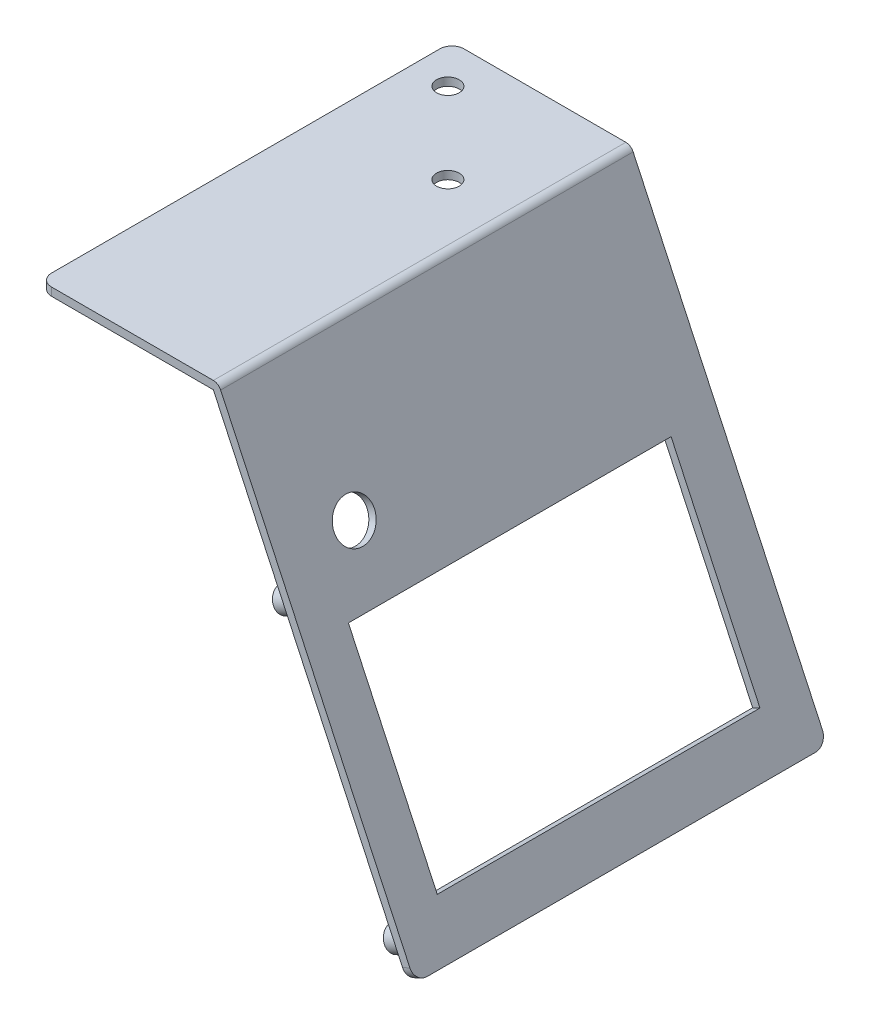
ISO-10303-21;
HEADER;
FILE_DESCRIPTION(('STEP AP214'),'2;1');
FILE_NAME('part.step','',(''),(''),'','','');
FILE_SCHEMA(('AUTOMOTIVE_DESIGN { 1 0 10303 214 1 1 1 1 }'));
ENDSEC;
DATA;
#1=APPLICATION_CONTEXT('core data for automotive mechanical design processes');
#2=APPLICATION_PROTOCOL_DEFINITION('international standard','automotive_design',2000,#1);
#3=PRODUCT_CONTEXT('',#1,'mechanical');
#4=PRODUCT('Part','Part','',(#3));
#5=PRODUCT_RELATED_PRODUCT_CATEGORY('part','',(#4));
#6=PRODUCT_DEFINITION_FORMATION('','',#4);
#7=PRODUCT_DEFINITION_CONTEXT('part definition',#1,'design');
#8=PRODUCT_DEFINITION('design','',#6,#7);
#9=PRODUCT_DEFINITION_SHAPE('','',#8);
#10=(LENGTH_UNIT() NAMED_UNIT(*) SI_UNIT(.MILLI.,.METRE.));
#11=(NAMED_UNIT(*) PLANE_ANGLE_UNIT() SI_UNIT($,.RADIAN.));
#12=(NAMED_UNIT(*) SI_UNIT($,.STERADIAN.) SOLID_ANGLE_UNIT());
#13=UNCERTAINTY_MEASURE_WITH_UNIT(LENGTH_MEASURE(1.E-05),#10,'distance_accuracy_value','');
#14=(GEOMETRIC_REPRESENTATION_CONTEXT(3) GLOBAL_UNCERTAINTY_ASSIGNED_CONTEXT((#13)) GLOBAL_UNIT_ASSIGNED_CONTEXT((#10,
#11,#12)) REPRESENTATION_CONTEXT('',''));
#15=CARTESIAN_POINT('',(0.,0.,0.));
#16=DIRECTION('',(0.,0.,1.));
#17=DIRECTION('',(1.,0.,0.));
#18=AXIS2_PLACEMENT_3D('',#15,#16,#17);
#19=CARTESIAN_POINT('',(34.5538891651414,16.1127431367447,0.));
#20=DIRECTION('',(0.906307787036648,0.422618261740704,0.));
#21=DIRECTION('',(-0.422618261740704,0.906307787036648,0.));
#22=AXIS2_PLACEMENT_3D('',#19,#20,#21);
#23=PLANE('',#22);
#24=CARTESIAN_POINT('',(61.1600718501967,-40.9443997596972,8.04999999999999));
#25=DIRECTION('',(0.906307787036648,0.422618261740704,0.));
#26=DIRECTION('',(-0.422618261740704,0.906307787036648,0.));
#27=AXIS2_PLACEMENT_3D('',#24,#25,#26);
#28=CIRCLE('',#27,1.35);
#29=CARTESIAN_POINT('',(60.5895371968468,-39.7208842471977,8.04999999999999));
#30=VERTEX_POINT('',#29);
#31=EDGE_CURVE('E22',#30,#30,#28,.F.);
#32=ORIENTED_EDGE('',*,*,#31,.T.);
#33=EDGE_LOOP('',(#32));
#34=FACE_BOUND('',#33,.T.);
#35=ADVANCED_FACE('F19',(#34),#23,.F.);
#36=CARTESIAN_POINT('',(34.5538891651414,16.1127431367447,0.));
#37=DIRECTION('',(0.906307787036648,0.422618261740704,0.));
#38=DIRECTION('',(-0.422618261740704,0.906307787036648,0.));
#39=AXIS2_PLACEMENT_3D('',#36,#37,#38);
#40=PLANE('',#39);
#41=CARTESIAN_POINT('',(88.5879970371684,-99.7637751383756,8.04999999999999));
#42=DIRECTION('',(0.906307787036648,0.422618261740704,0.));
#43=DIRECTION('',(-0.422618261740704,0.906307787036648,0.));
#44=AXIS2_PLACEMENT_3D('',#41,#42,#43);
#45=CIRCLE('',#44,1.34999999999999);
#46=CARTESIAN_POINT('',(88.0174623838184,-98.5402596258762,8.04999999999999));
#47=VERTEX_POINT('',#46);
#48=EDGE_CURVE('E235',#47,#47,#45,.F.);
#49=ORIENTED_EDGE('',*,*,#48,.T.);
#50=EDGE_LOOP('',(#49));
#51=FACE_BOUND('',#50,.T.);
#52=ADVANCED_FACE('F386',(#51),#40,.F.);
#53=CARTESIAN_POINT('',(34.5538891651414,16.1127431367447,0.));
#54=DIRECTION('',(0.906307787036648,0.422618261740704,0.));
#55=DIRECTION('',(-0.422618261740704,0.906307787036648,0.));
#56=AXIS2_PLACEMENT_3D('',#53,#54,#55);
#57=PLANE('',#56);
#58=CARTESIAN_POINT('',(88.5879970371684,-99.7637751383756,95.95));
#59=DIRECTION('',(0.906307787036648,0.422618261740704,0.));
#60=DIRECTION('',(-0.422618261740704,0.906307787036648,0.));
#61=AXIS2_PLACEMENT_3D('',#58,#59,#60);
#62=CIRCLE('',#61,1.35000000000001);
#63=CARTESIAN_POINT('',(88.0174623838184,-98.5402596258762,95.95));
#64=VERTEX_POINT('',#63);
#65=EDGE_CURVE('E233',#64,#64,#62,.F.);
#66=ORIENTED_EDGE('',*,*,#65,.T.);
#67=EDGE_LOOP('',(#66));
#68=FACE_BOUND('',#67,.T.);
#69=ADVANCED_FACE('F257',(#68),#57,.F.);
#70=CARTESIAN_POINT('',(34.5538891651414,16.1127431367447,0.));
#71=DIRECTION('',(0.906307787036648,0.422618261740704,0.));
#72=DIRECTION('',(-0.422618261740704,0.906307787036648,0.));
#73=AXIS2_PLACEMENT_3D('',#70,#71,#72);
#74=PLANE('',#73);
#75=CARTESIAN_POINT('',(61.1600718501967,-40.9443997596972,95.95));
#76=DIRECTION('',(0.906307787036648,0.422618261740704,0.));
#77=DIRECTION('',(-0.422618261740704,0.906307787036648,0.));
#78=AXIS2_PLACEMENT_3D('',#75,#76,#77);
#79=CIRCLE('',#78,1.35000000000001);
#80=CARTESIAN_POINT('',(60.5895371968467,-39.7208842471977,95.95));
#81=VERTEX_POINT('',#80);
#82=EDGE_CURVE('E230',#81,#81,#79,.F.);
#83=ORIENTED_EDGE('',*,*,#82,.T.);
#84=EDGE_LOOP('',(#83));
#85=FACE_BOUND('',#84,.T.);
#86=ADVANCED_FACE('F246',(#85),#74,.F.);
#87=CARTESIAN_POINT('',(54.8159173409402,-43.9027275918821,8.04999999999999));
#88=DIRECTION('',(0.906307787036648,0.422618261740704,0.));
#89=DIRECTION('',(-0.422618261740704,0.906307787036648,0.));
#90=AXIS2_PLACEMENT_3D('',#87,#88,#89);
#91=CYLINDRICAL_SURFACE('',#90,1.35);
#92=CARTESIAN_POINT('',(54.8159173409402,-43.9027275918821,8.04999999999999));
#93=DIRECTION('',(0.906307787036648,0.422618261740704,0.));
#94=DIRECTION('',(-0.422618261740704,0.906307787036648,0.));
#95=AXIS2_PLACEMENT_3D('',#92,#93,#94);
#96=CIRCLE('',#95,1.35);
#97=CARTESIAN_POINT('',(54.2453826875902,-42.6792120793826,8.04999999999999));
#98=VERTEX_POINT('',#97);
#99=EDGE_CURVE('E227',#98,#98,#96,.F.);
#100=ORIENTED_EDGE('',*,*,#99,.T.);
#101=EDGE_LOOP('',(#100));
#102=FACE_BOUND('',#101,.T.);
#103=ORIENTED_EDGE('',*,*,#31,.F.);
#104=EDGE_LOOP('',(#103));
#105=FACE_BOUND('',#104,.T.);
#106=ADVANCED_FACE('F243',(#102,#105),#91,.F.);
#107=CARTESIAN_POINT('',(82.2438425279118,-102.722102970561,8.04999999999999));
#108=DIRECTION('',(0.906307787036648,0.422618261740704,0.));
#109=DIRECTION('',(-0.422618261740704,0.906307787036648,0.));
#110=AXIS2_PLACEMENT_3D('',#107,#108,#109);
#111=CYLINDRICAL_SURFACE('',#110,1.34999999999999);
#112=CARTESIAN_POINT('',(82.2438425279118,-102.722102970561,8.04999999999999));
#113=DIRECTION('',(0.906307787036648,0.422618261740704,0.));
#114=DIRECTION('',(-0.422618261740704,0.906307787036648,0.));
#115=AXIS2_PLACEMENT_3D('',#112,#113,#114);
#116=CIRCLE('',#115,1.34999999999999);
#117=CARTESIAN_POINT('',(81.6733078745619,-101.498587458061,8.04999999999999));
#118=VERTEX_POINT('',#117);
#119=EDGE_CURVE('E224',#118,#118,#116,.F.);
#120=ORIENTED_EDGE('',*,*,#119,.T.);
#121=EDGE_LOOP('',(#120));
#122=FACE_BOUND('',#121,.T.);
#123=ORIENTED_EDGE('',*,*,#48,.F.);
#124=EDGE_LOOP('',(#123));
#125=FACE_BOUND('',#124,.T.);
#126=ADVANCED_FACE('F245',(#122,#125),#111,.F.);
#127=CARTESIAN_POINT('',(82.2438425279118,-102.722102970561,95.95));
#128=DIRECTION('',(0.906307787036648,0.422618261740704,0.));
#129=DIRECTION('',(-0.422618261740704,0.906307787036648,0.));
#130=AXIS2_PLACEMENT_3D('',#127,#128,#129);
#131=CYLINDRICAL_SURFACE('',#130,1.35000000000001);
#132=CARTESIAN_POINT('',(82.2438425279118,-102.722102970561,95.95));
#133=DIRECTION('',(0.906307787036648,0.422618261740704,0.));
#134=DIRECTION('',(-0.422618261740704,0.906307787036648,0.));
#135=AXIS2_PLACEMENT_3D('',#132,#133,#134);
#136=CIRCLE('',#135,1.35000000000001);
#137=CARTESIAN_POINT('',(81.6733078745619,-101.498587458061,95.95));
#138=VERTEX_POINT('',#137);
#139=EDGE_CURVE('E221',#138,#138,#136,.F.);
#140=ORIENTED_EDGE('',*,*,#139,.T.);
#141=EDGE_LOOP('',(#140));
#142=FACE_BOUND('',#141,.T.);
#143=ORIENTED_EDGE('',*,*,#65,.F.);
#144=EDGE_LOOP('',(#143));
#145=FACE_BOUND('',#144,.T.);
#146=ADVANCED_FACE('F254',(#142,#145),#131,.F.);
#147=CARTESIAN_POINT('',(54.8159173409402,-43.9027275918821,95.95));
#148=DIRECTION('',(0.906307787036648,0.422618261740704,0.));
#149=DIRECTION('',(-0.422618261740704,0.906307787036648,0.));
#150=AXIS2_PLACEMENT_3D('',#147,#148,#149);
#151=CYLINDRICAL_SURFACE('',#150,1.35000000000001);
#152=CARTESIAN_POINT('',(54.8159173409402,-43.9027275918821,95.95));
#153=DIRECTION('',(0.906307787036648,0.422618261740704,0.));
#154=DIRECTION('',(-0.422618261740704,0.906307787036648,0.));
#155=AXIS2_PLACEMENT_3D('',#152,#153,#154);
#156=CIRCLE('',#155,1.35000000000001);
#157=CARTESIAN_POINT('',(54.2453826875902,-42.6792120793826,95.95));
#158=VERTEX_POINT('',#157);
#159=EDGE_CURVE('E145',#158,#158,#156,.F.);
#160=ORIENTED_EDGE('',*,*,#159,.T.);
#161=EDGE_LOOP('',(#160));
#162=FACE_BOUND('',#161,.T.);
#163=ORIENTED_EDGE('',*,*,#82,.F.);
#164=EDGE_LOOP('',(#163));
#165=FACE_BOUND('',#164,.T.);
#166=ADVANCED_FACE('F372',(#162,#165),#151,.F.);
#167=CARTESIAN_POINT('',(54.8159173409402,-43.9027275918821,8.04999999999999));
#168=DIRECTION('',(0.906307787036648,0.422618261740704,0.));
#169=DIRECTION('',(-0.422618261740704,0.906307787036648,0.));
#170=AXIS2_PLACEMENT_3D('',#167,#168,#169);
#171=PLANE('',#170);
#172=CARTESIAN_POINT('',(54.8159173409402,-43.9027275918821,8.04999999999999));
#173=DIRECTION('',(0.906307787036648,0.422618261740704,0.));
#174=DIRECTION('',(-0.422618261740704,0.906307787036648,0.));
#175=AXIS2_PLACEMENT_3D('',#172,#173,#174);
#176=CIRCLE('',#175,3.);
#177=CARTESIAN_POINT('',(53.5480625557181,-41.1838042307722,8.04999999999999));
#178=VERTEX_POINT('',#177);
#179=EDGE_CURVE('E121',#178,#178,#176,.T.);
#180=ORIENTED_EDGE('',*,*,#179,.F.);
#181=EDGE_LOOP('',(#180));
#182=FACE_BOUND('',#181,.T.);
#183=ORIENTED_EDGE('',*,*,#99,.F.);
#184=EDGE_LOOP('',(#183));
#185=FACE_BOUND('',#184,.T.);
#186=ADVANCED_FACE('F368',(#182,#185),#171,.F.);
#187=CARTESIAN_POINT('',(82.2438425279118,-102.722102970561,8.04999999999999));
#188=DIRECTION('',(0.906307787036648,0.422618261740704,0.));
#189=DIRECTION('',(-0.422618261740704,0.906307787036648,0.));
#190=AXIS2_PLACEMENT_3D('',#187,#188,#189);
#191=PLANE('',#190);
#192=CARTESIAN_POINT('',(82.2438425279118,-102.722102970561,8.04999999999999));
#193=DIRECTION('',(0.906307787036648,0.422618261740704,0.));
#194=DIRECTION('',(-0.422618261740704,0.906307787036648,0.));
#195=AXIS2_PLACEMENT_3D('',#192,#193,#194);
#196=CIRCLE('',#195,3.);
#197=CARTESIAN_POINT('',(80.9759877426897,-100.003179609451,8.04999999999999));
#198=VERTEX_POINT('',#197);
#199=EDGE_CURVE('E214',#198,#198,#196,.T.);
#200=ORIENTED_EDGE('',*,*,#199,.F.);
#201=EDGE_LOOP('',(#200));
#202=FACE_BOUND('',#201,.T.);
#203=ORIENTED_EDGE('',*,*,#119,.F.);
#204=EDGE_LOOP('',(#203));
#205=FACE_BOUND('',#204,.T.);
#206=ADVANCED_FACE('F364',(#202,#205),#191,.F.);
#207=CARTESIAN_POINT('',(82.2438425279118,-102.722102970561,95.95));
#208=DIRECTION('',(0.906307787036648,0.422618261740704,0.));
#209=DIRECTION('',(-0.422618261740704,0.906307787036648,0.));
#210=AXIS2_PLACEMENT_3D('',#207,#208,#209);
#211=PLANE('',#210);
#212=CARTESIAN_POINT('',(82.2438425279118,-102.722102970561,95.95));
#213=DIRECTION('',(0.906307787036648,0.422618261740704,0.));
#214=DIRECTION('',(-0.422618261740704,0.906307787036648,0.));
#215=AXIS2_PLACEMENT_3D('',#212,#213,#214);
#216=CIRCLE('',#215,3.);
#217=CARTESIAN_POINT('',(80.9759877426897,-100.003179609451,95.95));
#218=VERTEX_POINT('',#217);
#219=EDGE_CURVE('E211',#218,#218,#216,.T.);
#220=ORIENTED_EDGE('',*,*,#219,.F.);
#221=EDGE_LOOP('',(#220));
#222=FACE_BOUND('',#221,.T.);
#223=ORIENTED_EDGE('',*,*,#139,.F.);
#224=EDGE_LOOP('',(#223));
#225=FACE_BOUND('',#224,.T.);
#226=ADVANCED_FACE('F360',(#222,#225),#211,.F.);
#227=CARTESIAN_POINT('',(54.8159173409402,-43.9027275918821,95.95));
#228=DIRECTION('',(0.906307787036648,0.422618261740704,0.));
#229=DIRECTION('',(-0.422618261740704,0.906307787036648,0.));
#230=AXIS2_PLACEMENT_3D('',#227,#228,#229);
#231=PLANE('',#230);
#232=CARTESIAN_POINT('',(54.8159173409402,-43.9027275918821,95.95));
#233=DIRECTION('',(0.906307787036648,0.422618261740704,0.));
#234=DIRECTION('',(-0.422618261740704,0.906307787036648,0.));
#235=AXIS2_PLACEMENT_3D('',#232,#233,#234);
#236=CIRCLE('',#235,3.00000000000001);
#237=CARTESIAN_POINT('',(53.5480625557181,-41.1838042307722,95.95));
#238=VERTEX_POINT('',#237);
#239=EDGE_CURVE('E208',#238,#238,#236,.T.);
#240=ORIENTED_EDGE('',*,*,#239,.F.);
#241=EDGE_LOOP('',(#240));
#242=FACE_BOUND('',#241,.T.);
#243=ORIENTED_EDGE('',*,*,#159,.F.);
#244=EDGE_LOOP('',(#243));
#245=FACE_BOUND('',#244,.T.);
#246=ADVANCED_FACE('F356',(#242,#245),#231,.F.);
#247=CARTESIAN_POINT('',(28.9999999999989,-8.5,29.9999999999999));
#248=DIRECTION('',(0.,1.,0.));
#249=DIRECTION('',(0.,0.,1.));
#250=AXIS2_PLACEMENT_3D('',#247,#248,#249);
#251=CYLINDRICAL_SURFACE('',#250,2.80000000000107);
#252=CARTESIAN_POINT('',(28.9999999999989,0.,29.9999999999999));
#253=DIRECTION('',(0.,1.,0.));
#254=DIRECTION('',(0.,0.,1.));
#255=AXIS2_PLACEMENT_3D('',#252,#253,#254);
#256=CIRCLE('',#255,2.80000000000107);
#257=CARTESIAN_POINT('',(28.9999999999989,0.,32.800000000001));
#258=VERTEX_POINT('',#257);
#259=EDGE_CURVE('E198',#258,#258,#256,.F.);
#260=ORIENTED_EDGE('',*,*,#259,.F.);
#261=EDGE_LOOP('',(#260));
#262=FACE_BOUND('',#261,.T.);
#263=CARTESIAN_POINT('',(28.9999999999989,-2.,29.9999999999999));
#264=DIRECTION('',(0.,1.,0.));
#265=DIRECTION('',(0.,0.,1.));
#266=AXIS2_PLACEMENT_3D('',#263,#264,#265);
#267=CIRCLE('',#266,2.80000000000107);
#268=CARTESIAN_POINT('',(28.9999999999989,-2.,32.800000000001));
#269=VERTEX_POINT('',#268);
#270=EDGE_CURVE('E205',#269,#269,#267,.F.);
#271=ORIENTED_EDGE('',*,*,#270,.T.);
#272=EDGE_LOOP('',(#271));
#273=FACE_BOUND('',#272,.T.);
#274=ADVANCED_FACE('F352',(#262,#273),#251,.F.);
#275=CARTESIAN_POINT('',(8.99999999999888,-8.5,9.99999999999991));
#276=DIRECTION('',(0.,1.,0.));
#277=DIRECTION('',(0.,0.,1.));
#278=AXIS2_PLACEMENT_3D('',#275,#276,#277);
#279=CYLINDRICAL_SURFACE('',#278,2.80000000000107);
#280=CARTESIAN_POINT('',(8.99999999999888,0.,9.99999999999991));
#281=DIRECTION('',(0.,1.,0.));
#282=DIRECTION('',(0.,0.,1.));
#283=AXIS2_PLACEMENT_3D('',#280,#281,#282);
#284=CIRCLE('',#283,2.80000000000107);
#285=CARTESIAN_POINT('',(8.99999999999888,0.,12.800000000001));
#286=VERTEX_POINT('',#285);
#287=EDGE_CURVE('E195',#286,#286,#284,.F.);
#288=ORIENTED_EDGE('',*,*,#287,.F.);
#289=EDGE_LOOP('',(#288));
#290=FACE_BOUND('',#289,.T.);
#291=CARTESIAN_POINT('',(8.99999999999888,-2.,9.99999999999991));
#292=DIRECTION('',(0.,1.,0.));
#293=DIRECTION('',(0.,0.,1.));
#294=AXIS2_PLACEMENT_3D('',#291,#292,#293);
#295=CIRCLE('',#294,2.80000000000107);
#296=CARTESIAN_POINT('',(8.99999999999888,-2.,12.800000000001));
#297=VERTEX_POINT('',#296);
#298=EDGE_CURVE('E113',#297,#297,#295,.F.);
#299=ORIENTED_EDGE('',*,*,#298,.T.);
#300=EDGE_LOOP('',(#299));
#301=FACE_BOUND('',#300,.T.);
#302=ADVANCED_FACE('F348',(#290,#301),#279,.F.);
#303=CARTESIAN_POINT('',(3.,0.,3.));
#304=DIRECTION('',(0.,1.,0.));
#305=DIRECTION('',(0.,0.,1.));
#306=AXIS2_PLACEMENT_3D('',#303,#304,#305);
#307=CYLINDRICAL_SURFACE('',#306,3.);
#308=CARTESIAN_POINT('',(3.,0.,3.));
#309=DIRECTION('',(0.,1.,0.));
#310=DIRECTION('',(0.,0.,1.));
#311=AXIS2_PLACEMENT_3D('',#308,#309,#310);
#312=CIRCLE('',#311,3.);
#313=CARTESIAN_POINT('',(3.,0.,0.));
#314=VERTEX_POINT('',#313);
#315=CARTESIAN_POINT('',(0.,0.,3.));
#316=VERTEX_POINT('',#315);
#317=EDGE_CURVE('E191',#314,#316,#312,.T.);
#318=ORIENTED_EDGE('',*,*,#317,.F.);
#319=DIRECTION('',(0.,1.,0.));
#320=VECTOR('',#319,1.);
#321=CARTESIAN_POINT('',(3.,0.,0.));
#322=LINE('',#321,#320);
#323=CARTESIAN_POINT('',(3.,-2.,0.));
#324=VERTEX_POINT('',#323);
#325=EDGE_CURVE('E143',#314,#324,#322,.F.);
#326=ORIENTED_EDGE('',*,*,#325,.T.);
#327=CARTESIAN_POINT('',(3.,-2.,3.));
#328=DIRECTION('',(0.,1.,0.));
#329=DIRECTION('',(0.,0.,1.));
#330=AXIS2_PLACEMENT_3D('',#327,#328,#329);
#331=CIRCLE('',#330,3.);
#332=CARTESIAN_POINT('',(0.,-2.,3.));
#333=VERTEX_POINT('',#332);
#334=EDGE_CURVE('E132',#324,#333,#331,.T.);
#335=ORIENTED_EDGE('',*,*,#334,.T.);
#336=DIRECTION('',(0.,1.,0.));
#337=VECTOR('',#336,1.);
#338=CARTESIAN_POINT('',(0.,-2.,3.));
#339=LINE('',#338,#337);
#340=EDGE_CURVE('E140',#316,#333,#339,.F.);
#341=ORIENTED_EDGE('',*,*,#340,.F.);
#342=EDGE_LOOP('',(#318,#326,#335,#341));
#343=FACE_BOUND('',#342,.T.);
#344=ADVANCED_FACE('F344',(#343),#307,.T.);
#345=CARTESIAN_POINT('',(0.,-2.,102.));
#346=DIRECTION('',(-1.,0.,0.));
#347=DIRECTION('',(0.,0.,1.));
#348=AXIS2_PLACEMENT_3D('',#345,#346,#347);
#349=PLANE('',#348);
#350=DIRECTION('',(0.,0.,1.));
#351=VECTOR('',#350,1.);
#352=CARTESIAN_POINT('',(0.,-2.,102.));
#353=LINE('',#352,#351);
#354=CARTESIAN_POINT('',(0.,-2.,99.));
#355=VERTEX_POINT('',#354);
#356=EDGE_CURVE('E201',#333,#355,#353,.T.);
#357=ORIENTED_EDGE('',*,*,#356,.T.);
#358=DIRECTION('',(0.,-1.,0.));
#359=VECTOR('',#358,1.);
#360=CARTESIAN_POINT('',(0.,-2.,99.));
#361=LINE('',#360,#359);
#362=CARTESIAN_POINT('',(0.,0.,99.));
#363=VERTEX_POINT('',#362);
#364=EDGE_CURVE('E101',#363,#355,#361,.T.);
#365=ORIENTED_EDGE('',*,*,#364,.F.);
#366=DIRECTION('',(0.,0.,1.));
#367=VECTOR('',#366,1.);
#368=CARTESIAN_POINT('',(0.,0.,102.));
#369=LINE('',#368,#367);
#370=EDGE_CURVE('E190',#316,#363,#369,.T.);
#371=ORIENTED_EDGE('',*,*,#370,.F.);
#372=ORIENTED_EDGE('',*,*,#340,.T.);
#373=EDGE_LOOP('',(#357,#365,#371,#372));
#374=FACE_BOUND('',#373,.T.);
#375=ADVANCED_FACE('F341',(#374),#349,.T.);
#376=CARTESIAN_POINT('',(3.,-2.,99.));
#377=DIRECTION('',(0.,-1.,0.));
#378=DIRECTION('',(0.,0.,-1.));
#379=AXIS2_PLACEMENT_3D('',#376,#377,#378);
#380=CYLINDRICAL_SURFACE('',#379,3.);
#381=CARTESIAN_POINT('',(3.,0.,99.));
#382=DIRECTION('',(0.,-1.,0.));
#383=DIRECTION('',(0.,0.,-1.));
#384=AXIS2_PLACEMENT_3D('',#381,#382,#383);
#385=CIRCLE('',#384,3.);
#386=CARTESIAN_POINT('',(3.,0.,102.));
#387=VERTEX_POINT('',#386);
#388=EDGE_CURVE('E188',#363,#387,#385,.F.);
#389=ORIENTED_EDGE('',*,*,#388,.F.);
#390=ORIENTED_EDGE('',*,*,#364,.T.);
#391=CARTESIAN_POINT('',(3.,-2.,99.));
#392=DIRECTION('',(0.,-1.,0.));
#393=DIRECTION('',(0.,0.,-1.));
#394=AXIS2_PLACEMENT_3D('',#391,#392,#393);
#395=CIRCLE('',#394,3.);
#396=CARTESIAN_POINT('',(3.,-2.,102.));
#397=VERTEX_POINT('',#396);
#398=EDGE_CURVE('E104',#355,#397,#395,.F.);
#399=ORIENTED_EDGE('',*,*,#398,.T.);
#400=DIRECTION('',(0.,1.,0.));
#401=VECTOR('',#400,1.);
#402=CARTESIAN_POINT('',(3.,0.,102.));
#403=LINE('',#402,#401);
#404=EDGE_CURVE('E107',#397,#387,#403,.T.);
#405=ORIENTED_EDGE('',*,*,#404,.T.);
#406=EDGE_LOOP('',(#389,#390,#399,#405));
#407=FACE_BOUND('',#406,.T.);
#408=ADVANCED_FACE('F106',(#407),#380,.T.);
#409=CARTESIAN_POINT('',(54.8159173409402,-43.9027275918821,8.04999999999999));
#410=DIRECTION('',(0.906307787036648,0.422618261740704,0.));
#411=DIRECTION('',(-0.422618261740704,0.906307787036648,0.));
#412=AXIS2_PLACEMENT_3D('',#409,#410,#411);
#413=CYLINDRICAL_SURFACE('',#412,3.);
#414=CARTESIAN_POINT('',(61.1600718501967,-40.9443997596972,8.04999999999999));
#415=DIRECTION('',(0.906307787036648,0.422618261740704,0.));
#416=DIRECTION('',(-0.422618261740704,0.906307787036648,0.));
#417=AXIS2_PLACEMENT_3D('',#414,#415,#416);
#418=CIRCLE('',#417,3.);
#419=CARTESIAN_POINT('',(59.8922170649746,-38.2254763985872,8.04999999999999));
#420=VERTEX_POINT('',#419);
#421=EDGE_CURVE('E185',#420,#420,#418,.F.);
#422=ORIENTED_EDGE('',*,*,#421,.T.);
#423=EDGE_LOOP('',(#422));
#424=FACE_BOUND('',#423,.T.);
#425=ORIENTED_EDGE('',*,*,#179,.T.);
#426=EDGE_LOOP('',(#425));
#427=FACE_BOUND('',#426,.T.);
#428=ADVANCED_FACE('F334',(#424,#427),#413,.T.);
#429=CARTESIAN_POINT('',(82.2438425279118,-102.722102970561,8.04999999999999));
#430=DIRECTION('',(0.906307787036648,0.422618261740704,0.));
#431=DIRECTION('',(-0.422618261740704,0.906307787036648,0.));
#432=AXIS2_PLACEMENT_3D('',#429,#430,#431);
#433=CYLINDRICAL_SURFACE('',#432,3.);
#434=CARTESIAN_POINT('',(88.5879970371684,-99.7637751383756,8.04999999999999));
#435=DIRECTION('',(0.906307787036648,0.422618261740704,0.));
#436=DIRECTION('',(-0.422618261740704,0.906307787036648,0.));
#437=AXIS2_PLACEMENT_3D('',#434,#435,#436);
#438=CIRCLE('',#437,3.);
#439=CARTESIAN_POINT('',(87.3201422519463,-97.0448517772657,8.04999999999999));
#440=VERTEX_POINT('',#439);
#441=EDGE_CURVE('E182',#440,#440,#438,.F.);
#442=ORIENTED_EDGE('',*,*,#441,.T.);
#443=EDGE_LOOP('',(#442));
#444=FACE_BOUND('',#443,.T.);
#445=ORIENTED_EDGE('',*,*,#199,.T.);
#446=EDGE_LOOP('',(#445));
#447=FACE_BOUND('',#446,.T.);
#448=ADVANCED_FACE('F330',(#444,#447),#433,.T.);
#449=CARTESIAN_POINT('',(82.2438425279118,-102.722102970561,95.95));
#450=DIRECTION('',(0.906307787036648,0.422618261740704,0.));
#451=DIRECTION('',(-0.422618261740704,0.906307787036648,0.));
#452=AXIS2_PLACEMENT_3D('',#449,#450,#451);
#453=CYLINDRICAL_SURFACE('',#452,3.);
#454=CARTESIAN_POINT('',(88.5879970371684,-99.7637751383756,95.95));
#455=DIRECTION('',(0.906307787036648,0.422618261740704,0.));
#456=DIRECTION('',(-0.422618261740704,0.906307787036648,0.));
#457=AXIS2_PLACEMENT_3D('',#454,#455,#456);
#458=CIRCLE('',#457,3.);
#459=CARTESIAN_POINT('',(87.3201422519463,-97.0448517772657,95.95));
#460=VERTEX_POINT('',#459);
#461=EDGE_CURVE('E179',#460,#460,#458,.F.);
#462=ORIENTED_EDGE('',*,*,#461,.T.);
#463=EDGE_LOOP('',(#462));
#464=FACE_BOUND('',#463,.T.);
#465=ORIENTED_EDGE('',*,*,#219,.T.);
#466=EDGE_LOOP('',(#465));
#467=FACE_BOUND('',#466,.T.);
#468=ADVANCED_FACE('F326',(#464,#467),#453,.T.);
#469=CARTESIAN_POINT('',(54.8159173409402,-43.9027275918821,95.95));
#470=DIRECTION('',(0.906307787036648,0.422618261740704,0.));
#471=DIRECTION('',(-0.422618261740704,0.906307787036648,0.));
#472=AXIS2_PLACEMENT_3D('',#469,#470,#471);
#473=CYLINDRICAL_SURFACE('',#472,3.00000000000001);
#474=CARTESIAN_POINT('',(61.1600718501967,-40.9443997596972,95.95));
#475=DIRECTION('',(0.906307787036648,0.422618261740704,0.));
#476=DIRECTION('',(-0.422618261740704,0.906307787036648,0.));
#477=AXIS2_PLACEMENT_3D('',#474,#475,#476);
#478=CIRCLE('',#477,3.00000000000001);
#479=CARTESIAN_POINT('',(59.8922170649746,-38.2254763985872,95.95));
#480=VERTEX_POINT('',#479);
#481=EDGE_CURVE('E176',#480,#480,#478,.F.);
#482=ORIENTED_EDGE('',*,*,#481,.T.);
#483=EDGE_LOOP('',(#482));
#484=FACE_BOUND('',#483,.T.);
#485=ORIENTED_EDGE('',*,*,#239,.T.);
#486=EDGE_LOOP('',(#485));
#487=FACE_BOUND('',#486,.T.);
#488=ADVANCED_FACE('F323',(#484,#487),#473,.T.);
#489=CARTESIAN_POINT('',(0.,-2.,102.));
#490=DIRECTION('',(0.,1.,0.));
#491=DIRECTION('',(0.,0.,1.));
#492=AXIS2_PLACEMENT_3D('',#489,#490,#491);
#493=PLANE('',#492);
#494=ORIENTED_EDGE('',*,*,#334,.F.);
#495=DIRECTION('',(1.,0.,0.));
#496=VECTOR('',#495,1.);
#497=CARTESIAN_POINT('',(0.,-2.,0.));
#498=LINE('',#497,#496);
#499=CARTESIAN_POINT('',(43.,-2.,0.));
#500=VERTEX_POINT('',#499);
#501=EDGE_CURVE('E130',#500,#324,#498,.F.);
#502=ORIENTED_EDGE('',*,*,#501,.F.);
#503=DIRECTION('',(0.,0.,1.));
#504=VECTOR('',#503,1.);
#505=CARTESIAN_POINT('',(43.,-2.00000000000001,0.));
#506=LINE('',#505,#504);
#507=CARTESIAN_POINT('',(43.,-2.,102.));
#508=VERTEX_POINT('',#507);
#509=EDGE_CURVE('E128',#500,#508,#506,.T.);
#510=ORIENTED_EDGE('',*,*,#509,.T.);
#511=DIRECTION('',(1.,0.,0.));
#512=VECTOR('',#511,1.);
#513=CARTESIAN_POINT('',(0.,-2.,102.));
#514=LINE('',#513,#512);
#515=EDGE_CURVE('E112',#397,#508,#514,.T.);
#516=ORIENTED_EDGE('',*,*,#515,.F.);
#517=ORIENTED_EDGE('',*,*,#398,.F.);
#518=ORIENTED_EDGE('',*,*,#356,.F.);
#519=EDGE_LOOP('',(#494,#502,#510,#516,#517,#518));
#520=FACE_BOUND('',#519,.T.);
#521=ORIENTED_EDGE('',*,*,#298,.F.);
#522=EDGE_LOOP('',(#521));
#523=FACE_BOUND('',#522,.T.);
#524=ORIENTED_EDGE('',*,*,#270,.F.);
#525=EDGE_LOOP('',(#524));
#526=FACE_BOUND('',#525,.T.);
#527=ADVANCED_FACE('F124',(#520,#523,#526),#493,.F.);
#528=CARTESIAN_POINT('',(0.,0.,102.));
#529=DIRECTION('',(0.,1.,0.));
#530=DIRECTION('',(0.,0.,1.));
#531=AXIS2_PLACEMENT_3D('',#528,#529,#530);
#532=PLANE('',#531);
#533=DIRECTION('',(1.,0.,0.));
#534=VECTOR('',#533,1.);
#535=CARTESIAN_POINT('',(0.,0.,102.));
#536=LINE('',#535,#534);
#537=CARTESIAN_POINT('',(43.,0.,102.));
#538=VERTEX_POINT('',#537);
#539=EDGE_CURVE('E119',#387,#538,#536,.T.);
#540=ORIENTED_EDGE('',*,*,#539,.T.);
#541=DIRECTION('',(0.,0.,-1.));
#542=VECTOR('',#541,1.);
#543=CARTESIAN_POINT('',(43.,0.,0.));
#544=LINE('',#543,#542);
#545=CARTESIAN_POINT('',(43.,0.,0.));
#546=VERTEX_POINT('',#545);
#547=EDGE_CURVE('E163',#546,#538,#544,.F.);
#548=ORIENTED_EDGE('',*,*,#547,.F.);
#549=DIRECTION('',(1.,0.,0.));
#550=VECTOR('',#549,1.);
#551=CARTESIAN_POINT('',(0.,0.,0.));
#552=LINE('',#551,#550);
#553=EDGE_CURVE('E194',#546,#314,#552,.F.);
#554=ORIENTED_EDGE('',*,*,#553,.T.);
#555=ORIENTED_EDGE('',*,*,#317,.T.);
#556=ORIENTED_EDGE('',*,*,#370,.T.);
#557=ORIENTED_EDGE('',*,*,#388,.T.);
#558=EDGE_LOOP('',(#540,#548,#554,#555,#556,#557));
#559=FACE_BOUND('',#558,.T.);
#560=ORIENTED_EDGE('',*,*,#287,.T.);
#561=EDGE_LOOP('',(#560));
#562=FACE_BOUND('',#561,.T.);
#563=ORIENTED_EDGE('',*,*,#259,.T.);
#564=EDGE_LOOP('',(#563));
#565=FACE_BOUND('',#564,.T.);
#566=ADVANCED_FACE('F316',(#559,#562,#565),#532,.T.);
#567=CARTESIAN_POINT('',(34.5538891651414,16.1127431367447,0.));
#568=DIRECTION('',(0.906307787036648,0.422618261740704,0.));
#569=DIRECTION('',(-0.422618261740704,0.906307787036648,0.));
#570=AXIS2_PLACEMENT_3D('',#567,#568,#569);
#571=PLANE('',#570);
#572=CARTESIAN_POINT('',(89.7947702625005,-102.351708671586,3.));
#573=DIRECTION('',(-0.906307787036648,-0.422618261740704,0.));
#574=DIRECTION('',(0.422618261740704,-0.906307787036648,0.));
#575=AXIS2_PLACEMENT_3D('',#572,#573,#574);
#576=CIRCLE('',#575,3.);
#577=CARTESIAN_POINT('',(91.0626250477226,-105.070632032696,3.));
#578=VERTEX_POINT('',#577);
#579=CARTESIAN_POINT('',(89.7947702625005,-102.351708671586,0.));
#580=VERTEX_POINT('',#579);
#581=EDGE_CURVE('E168',#578,#580,#576,.F.);
#582=ORIENTED_EDGE('',*,*,#581,.F.);
#583=DIRECTION('',(0.,0.,1.));
#584=VECTOR('',#583,1.);
#585=CARTESIAN_POINT('',(91.0626250477226,-105.070632032696,102.));
#586=LINE('',#585,#584);
#587=CARTESIAN_POINT('',(91.0626250477226,-105.070632032696,99.));
#588=VERTEX_POINT('',#587);
#589=EDGE_CURVE('E703',#588,#578,#586,.F.);
#590=ORIENTED_EDGE('',*,*,#589,.F.);
#591=CARTESIAN_POINT('',(89.7947702625005,-102.351708671586,99.));
#592=DIRECTION('',(-0.906307787036648,-0.422618261740704,0.));
#593=DIRECTION('',(0.422618261740704,-0.906307787036648,0.));
#594=AXIS2_PLACEMENT_3D('',#591,#592,#593);
#595=CIRCLE('',#594,3.);
#596=CARTESIAN_POINT('',(89.7947702625005,-102.351708671586,102.));
#597=VERTEX_POINT('',#596);
#598=EDGE_CURVE('E157',#597,#588,#595,.F.);
#599=ORIENTED_EDGE('',*,*,#598,.F.);
#600=DIRECTION('',(0.422618261740704,-0.906307787036648,0.));
#601=VECTOR('',#600,1.);
#602=CARTESIAN_POINT('',(43.,-2.,102.));
#603=LINE('',#602,#601);
#604=EDGE_CURVE('E162',#508,#597,#603,.T.);
#605=ORIENTED_EDGE('',*,*,#604,.F.);
#606=ORIENTED_EDGE('',*,*,#509,.F.);
#607=DIRECTION('',(-0.422618261740704,0.906307787036648,0.));
#608=VECTOR('',#607,1.);
#609=CARTESIAN_POINT('',(89.7947702625005,-102.351708671586,0.));
#610=LINE('',#609,#608);
#611=EDGE_CURVE('E167',#580,#500,#610,.T.);
#612=ORIENTED_EDGE('',*,*,#611,.F.);
#613=EDGE_LOOP('',(#582,#590,#599,#605,#606,#612));
#614=FACE_BOUND('',#613,.T.);
#615=DIRECTION('',(0.422618261740704,-0.906307787036648,0.));
#616=VECTOR('',#615,1.);
#617=CARTESIAN_POINT('',(63.8859596384243,-46.7900849860836,91.3));
#618=LINE('',#617,#616);
#619=CARTESIAN_POINT('',(63.8859596384243,-46.7900849860836,91.3));
#620=VERTEX_POINT('',#619);
#621=CARTESIAN_POINT('',(85.8621092489408,-93.9180899119893,91.3));
#622=VERTEX_POINT('',#621);
#623=EDGE_CURVE('E175',#620,#622,#618,.T.);
#624=ORIENTED_EDGE('',*,*,#623,.T.);
#625=DIRECTION('',(0.,0.,1.));
#626=VECTOR('',#625,1.);
#627=CARTESIAN_POINT('',(85.8621092489408,-93.9180899119893,91.3));
#628=LINE('',#627,#626);
#629=CARTESIAN_POINT('',(85.8621092489408,-93.9180899119893,11.5000000000001));
#630=VERTEX_POINT('',#629);
#631=EDGE_CURVE('E710',#622,#630,#628,.F.);
#632=ORIENTED_EDGE('',*,*,#631,.T.);
#633=DIRECTION('',(-0.422618261740704,0.906307787036648,0.));
#634=VECTOR('',#633,1.);
#635=CARTESIAN_POINT('',(85.8621092489408,-93.9180899119893,11.5));
#636=LINE('',#635,#634);
#637=CARTESIAN_POINT('',(63.8859596384243,-46.7900849860836,11.5000000000001));
#638=VERTEX_POINT('',#637);
#639=EDGE_CURVE('E716',#630,#638,#636,.T.);
#640=ORIENTED_EDGE('',*,*,#639,.T.);
#641=DIRECTION('',(0.,0.,1.));
#642=VECTOR('',#641,1.);
#643=CARTESIAN_POINT('',(63.8859596384243,-46.7900849860836,91.3));
#644=LINE('',#643,#642);
#645=EDGE_CURVE('E722',#638,#620,#644,.T.);
#646=ORIENTED_EDGE('',*,*,#645,.T.);
#647=EDGE_LOOP('',(#624,#632,#640,#646));
#648=FACE_BOUND('',#647,.T.);
#649=CARTESIAN_POINT('',(57.124067450573,-32.2891603934972,83.1));
#650=DIRECTION('',(0.906307787036648,0.422618261740704,0.));
#651=DIRECTION('',(-0.422618261740704,0.906307787036648,0.));
#652=AXIS2_PLACEMENT_3D('',#649,#650,#651);
#653=CIRCLE('',#652,5.);
#654=CARTESIAN_POINT('',(55.0109761418695,-27.757621458314,83.1));
#655=VERTEX_POINT('',#654);
#656=EDGE_CURVE('E172',#655,#655,#653,.T.);
#657=ORIENTED_EDGE('',*,*,#656,.T.);
#658=EDGE_LOOP('',(#657));
#659=FACE_BOUND('',#658,.T.);
#660=ORIENTED_EDGE('',*,*,#481,.F.);
#661=EDGE_LOOP('',(#660));
#662=FACE_BOUND('',#661,.T.);
#663=ORIENTED_EDGE('',*,*,#461,.F.);
#664=EDGE_LOOP('',(#663));
#665=FACE_BOUND('',#664,.T.);
#666=ORIENTED_EDGE('',*,*,#441,.F.);
#667=EDGE_LOOP('',(#666));
#668=FACE_BOUND('',#667,.T.);
#669=ORIENTED_EDGE('',*,*,#421,.F.);
#670=EDGE_LOOP('',(#669));
#671=FACE_BOUND('',#670,.T.);
#672=ADVANCED_FACE('F312',(#614,#648,#659,#662,#665,#668,#671),#571,.F.);
#673=CARTESIAN_POINT('',(49.8736051542798,-35.6701064874228,83.1));
#674=DIRECTION('',(0.906307787036648,0.422618261740704,0.));
#675=DIRECTION('',(-0.422618261740704,0.906307787036648,0.));
#676=AXIS2_PLACEMENT_3D('',#673,#674,#675);
#677=CYLINDRICAL_SURFACE('',#676,5.);
#678=CARTESIAN_POINT('',(58.9366830246463,-31.4439238700158,83.1));
#679=DIRECTION('',(0.906307787036648,0.422618261740704,0.));
#680=DIRECTION('',(-0.422618261740704,0.906307787036648,0.));
#681=AXIS2_PLACEMENT_3D('',#678,#679,#680);
#682=CIRCLE('',#681,5.);
#683=CARTESIAN_POINT('',(56.8235917159428,-26.9123849348326,83.1));
#684=VERTEX_POINT('',#683);
#685=EDGE_CURVE('E152',#684,#684,#682,.F.);
#686=ORIENTED_EDGE('',*,*,#685,.F.);
#687=EDGE_LOOP('',(#686));
#688=FACE_BOUND('',#687,.T.);
#689=ORIENTED_EDGE('',*,*,#656,.F.);
#690=EDGE_LOOP('',(#689));
#691=FACE_BOUND('',#690,.T.);
#692=ADVANCED_FACE('F308',(#688,#691),#677,.F.);
#693=CARTESIAN_POINT('',(56.6354973421311,-50.1710310800092,91.3));
#694=DIRECTION('',(0.,0.,1.));
#695=DIRECTION('',(1.,0.,0.));
#696=AXIS2_PLACEMENT_3D('',#693,#694,#695);
#697=PLANE('',#696);
#698=DIRECTION('',(-0.422618261740704,0.906307787036648,0.));
#699=VECTOR('',#698,1.);
#700=CARTESIAN_POINT('',(36.3665047392147,16.9579796602261,91.3));
#701=LINE('',#700,#699);
#702=CARTESIAN_POINT('',(87.6747248230141,-93.0728533885079,91.3));
#703=VERTEX_POINT('',#702);
#704=CARTESIAN_POINT('',(65.6985752124976,-45.9448484626022,91.3));
#705=VERTEX_POINT('',#704);
#706=EDGE_CURVE('E155',#703,#705,#701,.T.);
#707=ORIENTED_EDGE('',*,*,#706,.F.);
#708=DIRECTION('',(0.906307787036648,0.422618261740704,0.));
#709=VECTOR('',#708,1.);
#710=CARTESIAN_POINT('',(78.6116469526477,-97.2990360059149,91.3));
#711=LINE('',#710,#709);
#712=EDGE_CURVE('E704',#703,#622,#711,.F.);
#713=ORIENTED_EDGE('',*,*,#712,.T.);
#714=ORIENTED_EDGE('',*,*,#623,.F.);
#715=DIRECTION('',(-0.906307787036648,-0.422618261740704,0.));
#716=VECTOR('',#715,1.);
#717=CARTESIAN_POINT('',(56.6354973421311,-50.1710310800092,91.3));
#718=LINE('',#717,#716);
#719=EDGE_CURVE('E719',#620,#705,#718,.F.);
#720=ORIENTED_EDGE('',*,*,#719,.T.);
#721=EDGE_LOOP('',(#707,#713,#714,#720));
#722=FACE_BOUND('',#721,.T.);
#723=ADVANCED_FACE('F304',(#722),#697,.F.);
#724=CARTESIAN_POINT('',(56.6354973421311,-50.1710310800092,91.3));
#725=DIRECTION('',(-0.422618261740704,0.906307787036648,0.));
#726=DIRECTION('',(-0.906307787036648,-0.422618261740704,0.));
#727=AXIS2_PLACEMENT_3D('',#724,#725,#726);
#728=PLANE('',#727);
#729=DIRECTION('',(0.,0.,1.));
#730=VECTOR('',#729,1.);
#731=CARTESIAN_POINT('',(65.6985752124975,-45.9448484626022,0.));
#732=LINE('',#731,#730);
#733=CARTESIAN_POINT('',(65.6985752124976,-45.9448484626022,11.5000000000001));
#734=VERTEX_POINT('',#733);
#735=EDGE_CURVE('E746',#705,#734,#732,.F.);
#736=ORIENTED_EDGE('',*,*,#735,.F.);
#737=ORIENTED_EDGE('',*,*,#719,.F.);
#738=ORIENTED_EDGE('',*,*,#645,.F.);
#739=DIRECTION('',(0.906307787036648,0.422618261740703,0.));
#740=VECTOR('',#739,1.);
#741=CARTESIAN_POINT('',(63.8859596384243,-46.7900849860836,11.5000000000001));
#742=LINE('',#741,#740);
#743=EDGE_CURVE('E713',#638,#734,#742,.T.);
#744=ORIENTED_EDGE('',*,*,#743,.T.);
#745=EDGE_LOOP('',(#736,#737,#738,#744));
#746=FACE_BOUND('',#745,.T.);
#747=ADVANCED_FACE('F300',(#746),#728,.F.);
#748=CARTESIAN_POINT('',(56.6354973421311,-50.1710310800092,11.5000000000001));
#749=DIRECTION('',(0.,0.,-1.));
#750=DIRECTION('',(0.,1.,0.));
#751=AXIS2_PLACEMENT_3D('',#748,#749,#750);
#752=PLANE('',#751);
#753=DIRECTION('',(-0.422618261740704,0.906307787036648,0.));
#754=VECTOR('',#753,1.);
#755=CARTESIAN_POINT('',(36.3665047392147,16.9579796602261,11.5000000000001));
#756=LINE('',#755,#754);
#757=CARTESIAN_POINT('',(87.6747248230141,-93.0728533885079,11.5000000000001));
#758=VERTEX_POINT('',#757);
#759=EDGE_CURVE('E743',#734,#758,#756,.F.);
#760=ORIENTED_EDGE('',*,*,#759,.F.);
#761=ORIENTED_EDGE('',*,*,#743,.F.);
#762=ORIENTED_EDGE('',*,*,#639,.F.);
#763=DIRECTION('',(0.906307787036648,0.422618261740704,0.));
#764=VECTOR('',#763,1.);
#765=CARTESIAN_POINT('',(78.6116469526477,-97.2990360059149,11.5000000000001));
#766=LINE('',#765,#764);
#767=EDGE_CURVE('E707',#630,#758,#766,.T.);
#768=ORIENTED_EDGE('',*,*,#767,.T.);
#769=EDGE_LOOP('',(#760,#761,#762,#768));
#770=FACE_BOUND('',#769,.T.);
#771=ADVANCED_FACE('F296',(#770),#752,.F.);
#772=CARTESIAN_POINT('',(78.6116469526477,-97.2990360059149,91.3));
#773=DIRECTION('',(0.422618261740704,-0.906307787036648,0.));
#774=DIRECTION('',(0.906307787036648,0.422618261740704,0.));
#775=AXIS2_PLACEMENT_3D('',#772,#773,#774);
#776=PLANE('',#775);
#777=DIRECTION('',(0.,0.,1.));
#778=VECTOR('',#777,1.);
#779=CARTESIAN_POINT('',(87.6747248230141,-93.0728533885079,0.));
#780=LINE('',#779,#778);
#781=EDGE_CURVE('E740',#758,#703,#780,.T.);
#782=ORIENTED_EDGE('',*,*,#781,.F.);
#783=ORIENTED_EDGE('',*,*,#767,.F.);
#784=ORIENTED_EDGE('',*,*,#631,.F.);
#785=ORIENTED_EDGE('',*,*,#712,.F.);
#786=EDGE_LOOP('',(#782,#783,#784,#785));
#787=FACE_BOUND('',#786,.T.);
#788=ADVANCED_FACE('F292',(#787),#776,.F.);
#789=CARTESIAN_POINT('',(92.8752406217959,-104.225395509215,102.));
#790=DIRECTION('',(0.422618261740704,-0.906307787036648,0.));
#791=DIRECTION('',(0.906307787036648,0.422618261740704,0.));
#792=AXIS2_PLACEMENT_3D('',#789,#790,#791);
#793=PLANE('',#792);
#794=DIRECTION('',(0.,0.,1.));
#795=VECTOR('',#794,1.);
#796=CARTESIAN_POINT('',(92.8752406217959,-104.225395509215,0.));
#797=LINE('',#796,#795);
#798=CARTESIAN_POINT('',(92.8752406217959,-104.225395509215,99.));
#799=VERTEX_POINT('',#798);
#800=CARTESIAN_POINT('',(92.8752406217959,-104.225395509215,3.));
#801=VERTEX_POINT('',#800);
#802=EDGE_CURVE('E151',#799,#801,#797,.F.);
#803=ORIENTED_EDGE('',*,*,#802,.F.);
#804=DIRECTION('',(-0.906307787036648,-0.422618261740704,0.));
#805=VECTOR('',#804,1.);
#806=CARTESIAN_POINT('',(92.8752406217959,-104.225395509215,99.));
#807=LINE('',#806,#805);
#808=EDGE_CURVE('E156',#588,#799,#807,.F.);
#809=ORIENTED_EDGE('',*,*,#808,.F.);
#810=ORIENTED_EDGE('',*,*,#589,.T.);
#811=DIRECTION('',(-0.906307787036648,-0.422618261740704,0.));
#812=VECTOR('',#811,1.);
#813=CARTESIAN_POINT('',(92.8752406217959,-104.225395509215,3.));
#814=LINE('',#813,#812);
#815=EDGE_CURVE('E171',#801,#578,#814,.T.);
#816=ORIENTED_EDGE('',*,*,#815,.F.);
#817=EDGE_LOOP('',(#803,#809,#810,#816));
#818=FACE_BOUND('',#817,.T.);
#819=ADVANCED_FACE('F288',(#818),#793,.T.);
#820=CARTESIAN_POINT('',(91.6073858365738,-101.506472148105,3.));
#821=DIRECTION('',(-0.906307787036648,-0.422618261740704,0.));
#822=DIRECTION('',(0.422618261740704,-0.906307787036648,0.));
#823=AXIS2_PLACEMENT_3D('',#820,#821,#822);
#824=CYLINDRICAL_SURFACE('',#823,3.);
#825=ORIENTED_EDGE('',*,*,#581,.T.);
#826=DIRECTION('',(-0.906307787036647,-0.422618261740706,0.));
#827=VECTOR('',#826,1.);
#828=CARTESIAN_POINT('',(91.6073858365738,-101.506472148105,0.));
#829=LINE('',#828,#827);
#830=CARTESIAN_POINT('',(91.6073858365738,-101.506472148105,0.));
#831=VERTEX_POINT('',#830);
#832=EDGE_CURVE('E170',#831,#580,#829,.T.);
#833=ORIENTED_EDGE('',*,*,#832,.F.);
#834=CARTESIAN_POINT('',(91.6073858365738,-101.506472148105,3.));
#835=DIRECTION('',(-0.906307787036648,-0.422618261740704,0.));
#836=DIRECTION('',(0.422618261740704,-0.906307787036648,0.));
#837=AXIS2_PLACEMENT_3D('',#834,#835,#836);
#838=CIRCLE('',#837,3.);
#839=EDGE_CURVE('E147',#801,#831,#838,.F.);
#840=ORIENTED_EDGE('',*,*,#839,.F.);
#841=ORIENTED_EDGE('',*,*,#815,.T.);
#842=EDGE_LOOP('',(#825,#833,#840,#841));
#843=FACE_BOUND('',#842,.T.);
#844=ADVANCED_FACE('F284',(#843),#824,.T.);
#845=CARTESIAN_POINT('',(92.8752406217959,-104.225395509215,0.));
#846=DIRECTION('',(0.,0.,-1.));
#847=DIRECTION('',(-1.,0.,0.));
#848=AXIS2_PLACEMENT_3D('',#845,#846,#847);
#849=PLANE('',#848);
#850=ORIENTED_EDGE('',*,*,#611,.T.);
#851=ORIENTED_EDGE('',*,*,#501,.T.);
#852=ORIENTED_EDGE('',*,*,#325,.F.);
#853=ORIENTED_EDGE('',*,*,#553,.F.);
#854=CARTESIAN_POINT('',(43.,-2.,0.));
#855=DIRECTION('',(0.,0.,-1.));
#856=DIRECTION('',(-1.,0.,0.));
#857=AXIS2_PLACEMENT_3D('',#854,#855,#856);
#858=CIRCLE('',#857,2.);
#859=CARTESIAN_POINT('',(44.8126155740733,-1.15476347651859,0.));
#860=VERTEX_POINT('',#859);
#861=EDGE_CURVE('E164',#860,#546,#858,.F.);
#862=ORIENTED_EDGE('',*,*,#861,.F.);
#863=DIRECTION('',(-0.422618261740704,0.906307787036648,0.));
#864=VECTOR('',#863,1.);
#865=CARTESIAN_POINT('',(36.3665047392147,16.9579796602261,0.));
#866=LINE('',#865,#864);
#867=EDGE_CURVE('E150',#831,#860,#866,.T.);
#868=ORIENTED_EDGE('',*,*,#867,.F.);
#869=ORIENTED_EDGE('',*,*,#832,.T.);
#870=EDGE_LOOP('',(#850,#851,#852,#853,#862,#868,#869));
#871=FACE_BOUND('',#870,.T.);
#872=ADVANCED_FACE('F280',(#871),#849,.T.);
#873=CARTESIAN_POINT('',(43.,-2.,0.));
#874=DIRECTION('',(0.,0.,-1.));
#875=DIRECTION('',(-1.,0.,0.));
#876=AXIS2_PLACEMENT_3D('',#873,#874,#875);
#877=CYLINDRICAL_SURFACE('',#876,2.);
#878=CARTESIAN_POINT('',(43.,-2.,102.));
#879=DIRECTION('',(0.,0.,-1.));
#880=DIRECTION('',(-1.,0.,0.));
#881=AXIS2_PLACEMENT_3D('',#878,#879,#880);
#882=CIRCLE('',#881,2.);
#883=CARTESIAN_POINT('',(44.8126155740733,-1.15476347651859,102.));
#884=VERTEX_POINT('',#883);
#885=EDGE_CURVE('E160',#538,#884,#882,.T.);
#886=ORIENTED_EDGE('',*,*,#885,.T.);
#887=DIRECTION('',(0.,0.,1.));
#888=VECTOR('',#887,1.);
#889=CARTESIAN_POINT('',(44.8126155740733,-1.1547634765186,0.));
#890=LINE('',#889,#888);
#891=EDGE_CURVE('E699',#860,#884,#890,.T.);
#892=ORIENTED_EDGE('',*,*,#891,.F.);
#893=ORIENTED_EDGE('',*,*,#861,.T.);
#894=ORIENTED_EDGE('',*,*,#547,.T.);
#895=EDGE_LOOP('',(#886,#892,#893,#894));
#896=FACE_BOUND('',#895,.T.);
#897=ADVANCED_FACE('F277',(#896),#877,.T.);
#898=CARTESIAN_POINT('',(44.8126155740733,-1.15476347651859,102.));
#899=DIRECTION('',(0.,0.,1.));
#900=DIRECTION('',(1.,0.,0.));
#901=AXIS2_PLACEMENT_3D('',#898,#899,#900);
#902=PLANE('',#901);
#903=DIRECTION('',(-0.422618261740704,0.906307787036648,0.));
#904=VECTOR('',#903,1.);
#905=CARTESIAN_POINT('',(36.3665047392147,16.9579796602261,102.));
#906=LINE('',#905,#904);
#907=CARTESIAN_POINT('',(91.6073858365738,-101.506472148105,102.));
#908=VERTEX_POINT('',#907);
#909=EDGE_CURVE('E28',#884,#908,#906,.F.);
#910=ORIENTED_EDGE('',*,*,#909,.F.);
#911=ORIENTED_EDGE('',*,*,#885,.F.);
#912=ORIENTED_EDGE('',*,*,#539,.F.);
#913=ORIENTED_EDGE('',*,*,#404,.F.);
#914=ORIENTED_EDGE('',*,*,#515,.T.);
#915=ORIENTED_EDGE('',*,*,#604,.T.);
#916=DIRECTION('',(-0.906307787036648,-0.422618261740704,0.));
#917=VECTOR('',#916,1.);
#918=CARTESIAN_POINT('',(91.6073858365738,-101.506472148105,102.));
#919=LINE('',#918,#917);
#920=EDGE_CURVE('E37',#908,#597,#919,.T.);
#921=ORIENTED_EDGE('',*,*,#920,.F.);
#922=EDGE_LOOP('',(#910,#911,#912,#913,#914,#915,#921));
#923=FACE_BOUND('',#922,.T.);
#924=ADVANCED_FACE('F116',(#923),#902,.T.);
#925=CARTESIAN_POINT('',(91.6073858365738,-101.506472148105,99.));
#926=DIRECTION('',(-0.906307787036648,-0.422618261740704,0.));
#927=DIRECTION('',(0.422618261740704,-0.906307787036648,0.));
#928=AXIS2_PLACEMENT_3D('',#925,#926,#927);
#929=CYLINDRICAL_SURFACE('',#928,3.);
#930=ORIENTED_EDGE('',*,*,#598,.T.);
#931=ORIENTED_EDGE('',*,*,#808,.T.);
#932=CARTESIAN_POINT('',(91.6073858365738,-101.506472148105,99.));
#933=DIRECTION('',(-0.906307787036648,-0.422618261740704,0.));
#934=DIRECTION('',(0.422618261740704,-0.906307787036648,0.));
#935=AXIS2_PLACEMENT_3D('',#932,#933,#934);
#936=CIRCLE('',#935,3.);
#937=EDGE_CURVE('E11',#908,#799,#936,.F.);
#938=ORIENTED_EDGE('',*,*,#937,.F.);
#939=ORIENTED_EDGE('',*,*,#920,.T.);
#940=EDGE_LOOP('',(#930,#931,#938,#939));
#941=FACE_BOUND('',#940,.T.);
#942=ADVANCED_FACE('F262',(#941),#929,.T.);
#943=CARTESIAN_POINT('',(36.3665047392147,16.9579796602261,0.));
#944=DIRECTION('',(0.906307787036648,0.422618261740704,0.));
#945=DIRECTION('',(-0.422618261740704,0.906307787036648,0.));
#946=AXIS2_PLACEMENT_3D('',#943,#944,#945);
#947=PLANE('',#946);
#948=ORIENTED_EDGE('',*,*,#909,.T.);
#949=ORIENTED_EDGE('',*,*,#937,.T.);
#950=ORIENTED_EDGE('',*,*,#802,.T.);
#951=ORIENTED_EDGE('',*,*,#839,.T.);
#952=ORIENTED_EDGE('',*,*,#867,.T.);
#953=ORIENTED_EDGE('',*,*,#891,.T.);
#954=EDGE_LOOP('',(#948,#949,#950,#951,#952,#953));
#955=FACE_BOUND('',#954,.T.);
#956=ORIENTED_EDGE('',*,*,#759,.T.);
#957=ORIENTED_EDGE('',*,*,#781,.T.);
#958=ORIENTED_EDGE('',*,*,#706,.T.);
#959=ORIENTED_EDGE('',*,*,#735,.T.);
#960=EDGE_LOOP('',(#956,#957,#958,#959));
#961=FACE_BOUND('',#960,.T.);
#962=ORIENTED_EDGE('',*,*,#685,.T.);
#963=EDGE_LOOP('',(#962));
#964=FACE_BOUND('',#963,.T.);
#965=ADVANCED_FACE('F260',(#955,#961,#964),#947,.T.);
#966=CLOSED_SHELL('',(#35,#52,#69,#86,#106,#126,#146,#166,#186,#206,#226,#246,#274,#302,#344,
#375,#408,#428,#448,#468,#488,#527,#566,#672,#692,#723,#747,#771,#788,#819,#844,#872,#897,#924,
#942,#965));
#967=MANIFOLD_SOLID_BREP('B1',#966);
#968=ADVANCED_BREP_SHAPE_REPRESENTATION('',(#18,#967),#14);
#969=SHAPE_DEFINITION_REPRESENTATION(#9,#968);
ENDSEC;
END-ISO-10303-21;
